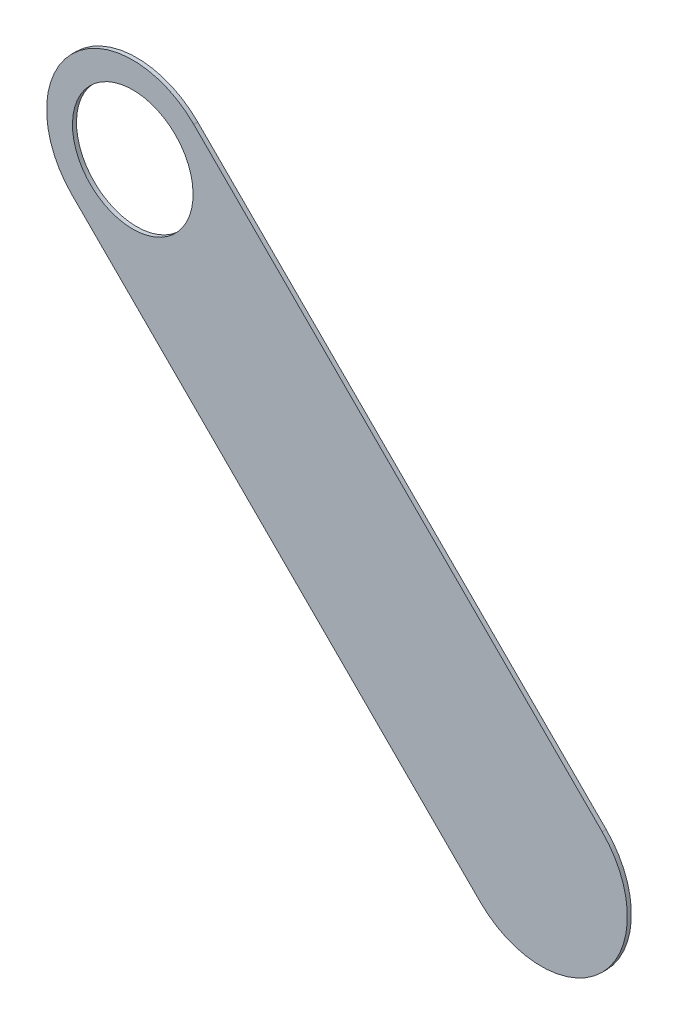
ISO-10303-21;
HEADER;
FILE_DESCRIPTION(('STEP AP214'),'2;1');
FILE_NAME('part.step','',(''),(''),'','','');
FILE_SCHEMA(('AUTOMOTIVE_DESIGN { 1 0 10303 214 1 1 1 1 }'));
ENDSEC;
DATA;
#1=APPLICATION_CONTEXT('core data for automotive mechanical design processes');
#2=APPLICATION_PROTOCOL_DEFINITION('international standard','automotive_design',2000,#1);
#3=PRODUCT_CONTEXT('',#1,'mechanical');
#4=PRODUCT('Part','Part','',(#3));
#5=PRODUCT_RELATED_PRODUCT_CATEGORY('part','',(#4));
#6=PRODUCT_DEFINITION_FORMATION('','',#4);
#7=PRODUCT_DEFINITION_CONTEXT('part definition',#1,'design');
#8=PRODUCT_DEFINITION('design','',#6,#7);
#9=PRODUCT_DEFINITION_SHAPE('','',#8);
#10=(LENGTH_UNIT() NAMED_UNIT(*) SI_UNIT(.MILLI.,.METRE.));
#11=(NAMED_UNIT(*) PLANE_ANGLE_UNIT() SI_UNIT($,.RADIAN.));
#12=(NAMED_UNIT(*) SI_UNIT($,.STERADIAN.) SOLID_ANGLE_UNIT());
#13=UNCERTAINTY_MEASURE_WITH_UNIT(LENGTH_MEASURE(1.E-05),#10,'distance_accuracy_value','');
#14=(GEOMETRIC_REPRESENTATION_CONTEXT(3) GLOBAL_UNCERTAINTY_ASSIGNED_CONTEXT((#13)) GLOBAL_UNIT_ASSIGNED_CONTEXT((#10,
#11,#12)) REPRESENTATION_CONTEXT('',''));
#15=CARTESIAN_POINT('',(0.,0.,0.));
#16=DIRECTION('',(0.,0.,1.));
#17=DIRECTION('',(1.,0.,0.));
#18=AXIS2_PLACEMENT_3D('',#15,#16,#17);
#19=CARTESIAN_POINT('',(123.952,-121.234,-0.045));
#20=DIRECTION('',(0.,0.,-1.));
#21=DIRECTION('',(0.,-1.,0.));
#22=AXIS2_PLACEMENT_3D('',#19,#20,#21);
#23=CYLINDRICAL_SURFACE('',#22,0.525);
#24=CARTESIAN_POINT('',(123.952,-121.234,-0.035));
#25=DIRECTION('',(0.,0.,-1.));
#26=DIRECTION('',(0.,-1.,0.));
#27=AXIS2_PLACEMENT_3D('',#24,#25,#26);
#28=CIRCLE('',#27,0.525);
#29=CARTESIAN_POINT('',(123.952,-121.759,-0.035));
#30=VERTEX_POINT('',#29);
#31=EDGE_CURVE('E132',#30,#30,#28,.T.);
#32=ORIENTED_EDGE('',*,*,#31,.T.);
#33=DIRECTION('',(0.,0.,1.));
#34=VECTOR('',#33,1.);
#35=CARTESIAN_POINT('',(123.952,-121.759,-0.045));
#36=LINE('',#35,#34);
#37=CARTESIAN_POINT('',(123.952,-121.759,0.));
#38=VERTEX_POINT('',#37);
#39=EDGE_CURVE('E11',#30,#38,#36,.T.);
#40=ORIENTED_EDGE('',*,*,#39,.T.);
#41=CARTESIAN_POINT('',(123.952,-121.234,0.));
#42=DIRECTION('',(0.,0.,-1.));
#43=DIRECTION('',(0.,-1.,0.));
#44=AXIS2_PLACEMENT_3D('',#41,#42,#43);
#45=CIRCLE('',#44,0.525);
#46=EDGE_CURVE('E26',#38,#38,#45,.T.);
#47=ORIENTED_EDGE('',*,*,#46,.F.);
#48=ORIENTED_EDGE('',*,*,#39,.F.);
#49=EDGE_LOOP('',(#32,#40,#47,#48));
#50=FACE_BOUND('',#49,.T.);
#51=ADVANCED_FACE('F17',(#50),#23,.F.);
#52=CARTESIAN_POINT('',(128.03833,-124.259669,-0.035));
#53=DIRECTION('',(-0.707106781186548,-0.707106781186548,0.));
#54=DIRECTION('',(-0.707106781186548,0.707106781186548,0.));
#55=AXIS2_PLACEMENT_3D('',#52,#53,#54);
#56=PLANE('',#55);
#57=DIRECTION('',(-0.707106781186548,0.707106781186548,0.));
#58=VECTOR('',#57,1.);
#59=CARTESIAN_POINT('',(128.03833,-124.259669,-0.035));
#60=LINE('',#59,#58);
#61=CARTESIAN_POINT('',(128.03833,-124.259669,-0.035));
#62=VERTEX_POINT('',#61);
#63=CARTESIAN_POINT('',(124.48233,-120.703669,-0.035));
#64=VERTEX_POINT('',#63);
#65=EDGE_CURVE('E130',#62,#64,#60,.T.);
#66=ORIENTED_EDGE('',*,*,#65,.T.);
#67=DIRECTION('',(0.,0.,1.));
#68=VECTOR('',#67,1.);
#69=CARTESIAN_POINT('',(124.48233,-120.703669,-0.035));
#70=LINE('',#69,#68);
#71=CARTESIAN_POINT('',(124.48233,-120.703669,0.));
#72=VERTEX_POINT('',#71);
#73=EDGE_CURVE('E85',#64,#72,#70,.T.);
#74=ORIENTED_EDGE('',*,*,#73,.T.);
#75=DIRECTION('',(-0.707106781186548,0.707106781186548,0.));
#76=VECTOR('',#75,1.);
#77=CARTESIAN_POINT('',(128.03833,-124.259669,0.));
#78=LINE('',#77,#76);
#79=CARTESIAN_POINT('',(128.03833,-124.259669,0.));
#80=VERTEX_POINT('',#79);
#81=EDGE_CURVE('E20',#80,#72,#78,.T.);
#82=ORIENTED_EDGE('',*,*,#81,.F.);
#83=DIRECTION('',(0.,0.,1.));
#84=VECTOR('',#83,1.);
#85=CARTESIAN_POINT('',(128.03833,-124.259669,-0.035));
#86=LINE('',#85,#84);
#87=EDGE_CURVE('E114',#62,#80,#86,.T.);
#88=ORIENTED_EDGE('',*,*,#87,.F.);
#89=EDGE_LOOP('',(#66,#74,#82,#88));
#90=FACE_BOUND('',#89,.T.);
#91=ADVANCED_FACE('F144',(#90),#56,.F.);
#92=CARTESIAN_POINT('',(123.421669,-121.76433,0.));
#93=DIRECTION('',(0.,0.,1.));
#94=DIRECTION('',(1.,0.,0.));
#95=AXIS2_PLACEMENT_3D('',#92,#93,#94);
#96=PLANE('',#95);
#97=ORIENTED_EDGE('',*,*,#46,.T.);
#98=EDGE_LOOP('',(#97));
#99=FACE_BOUND('',#98,.T.);
#100=DIRECTION('',(0.707106781186548,-0.707106781186548,0.));
#101=VECTOR('',#100,1.);
#102=CARTESIAN_POINT('',(123.421669,-121.76433,0.));
#103=LINE('',#102,#101);
#104=CARTESIAN_POINT('',(123.421669,-121.76433,0.));
#105=VERTEX_POINT('',#104);
#106=CARTESIAN_POINT('',(126.977669,-125.32033,0.));
#107=VERTEX_POINT('',#106);
#108=EDGE_CURVE('E97',#105,#107,#103,.T.);
#109=ORIENTED_EDGE('',*,*,#108,.T.);
#110=CARTESIAN_POINT('',(127.5079995,-124.7899995,0.));
#111=DIRECTION('',(0.,0.,1.));
#112=DIRECTION('',(-0.707106781186548,-0.707106781186548,0.));
#113=AXIS2_PLACEMENT_3D('',#110,#111,#112);
#114=CIRCLE('',#113,0.75000058564);
#115=EDGE_CURVE('E118',#107,#80,#114,.T.);
#116=ORIENTED_EDGE('',*,*,#115,.T.);
#117=ORIENTED_EDGE('',*,*,#81,.T.);
#118=CARTESIAN_POINT('',(123.9519995,-121.2339995,0.));
#119=DIRECTION('',(0.,0.,1.));
#120=DIRECTION('',(0.707106781186548,0.707106781186548,0.));
#121=AXIS2_PLACEMENT_3D('',#118,#119,#120);
#122=CIRCLE('',#121,0.75000058564);
#123=EDGE_CURVE('E89',#72,#105,#122,.T.);
#124=ORIENTED_EDGE('',*,*,#123,.T.);
#125=EDGE_LOOP('',(#109,#116,#117,#124));
#126=FACE_BOUND('',#125,.T.);
#127=ADVANCED_FACE('F141',(#99,#126),#96,.T.);
#128=CARTESIAN_POINT('',(123.421669,-121.76433,-0.035));
#129=DIRECTION('',(0.,0.,1.));
#130=DIRECTION('',(1.,0.,0.));
#131=AXIS2_PLACEMENT_3D('',#128,#129,#130);
#132=PLANE('',#131);
#133=ORIENTED_EDGE('',*,*,#31,.F.);
#134=EDGE_LOOP('',(#133));
#135=FACE_BOUND('',#134,.T.);
#136=CARTESIAN_POINT('',(123.9519995,-121.2339995,-0.035));
#137=DIRECTION('',(0.,0.,1.));
#138=DIRECTION('',(0.707106781186548,0.707106781186548,0.));
#139=AXIS2_PLACEMENT_3D('',#136,#137,#138);
#140=CIRCLE('',#139,0.75000058564);
#141=CARTESIAN_POINT('',(123.421669,-121.76433,-0.035));
#142=VERTEX_POINT('',#141);
#143=EDGE_CURVE('E78',#64,#142,#140,.T.);
#144=ORIENTED_EDGE('',*,*,#143,.F.);
#145=ORIENTED_EDGE('',*,*,#65,.F.);
#146=CARTESIAN_POINT('',(127.5079995,-124.7899995,-0.035));
#147=DIRECTION('',(0.,0.,1.));
#148=DIRECTION('',(-0.707106781186548,-0.707106781186548,0.));
#149=AXIS2_PLACEMENT_3D('',#146,#147,#148);
#150=CIRCLE('',#149,0.75000058564);
#151=CARTESIAN_POINT('',(126.977669,-125.32033,-0.035));
#152=VERTEX_POINT('',#151);
#153=EDGE_CURVE('E102',#152,#62,#150,.T.);
#154=ORIENTED_EDGE('',*,*,#153,.F.);
#155=DIRECTION('',(0.707106781186548,-0.707106781186548,0.));
#156=VECTOR('',#155,1.);
#157=CARTESIAN_POINT('',(123.421669,-121.76433,-0.035));
#158=LINE('',#157,#156);
#159=EDGE_CURVE('E95',#142,#152,#158,.T.);
#160=ORIENTED_EDGE('',*,*,#159,.F.);
#161=EDGE_LOOP('',(#144,#145,#154,#160));
#162=FACE_BOUND('',#161,.T.);
#163=ADVANCED_FACE('F100',(#135,#162),#132,.F.);
#164=CARTESIAN_POINT('',(127.5079995,-124.7899995,-0.035));
#165=DIRECTION('',(0.,0.,-1.));
#166=DIRECTION('',(-0.707106781186548,-0.707106781186548,0.));
#167=AXIS2_PLACEMENT_3D('',#164,#165,#166);
#168=CYLINDRICAL_SURFACE('',#167,0.75000058564);
#169=ORIENTED_EDGE('',*,*,#153,.T.);
#170=ORIENTED_EDGE('',*,*,#87,.T.);
#171=ORIENTED_EDGE('',*,*,#115,.F.);
#172=DIRECTION('',(0.,0.,1.));
#173=VECTOR('',#172,1.);
#174=CARTESIAN_POINT('',(126.977669,-125.32033,-0.035));
#175=LINE('',#174,#173);
#176=EDGE_CURVE('E105',#152,#107,#175,.T.);
#177=ORIENTED_EDGE('',*,*,#176,.F.);
#178=EDGE_LOOP('',(#169,#170,#171,#177));
#179=FACE_BOUND('',#178,.T.);
#180=ADVANCED_FACE('F146',(#179),#168,.T.);
#181=CARTESIAN_POINT('',(123.9519995,-121.2339995,-0.035));
#182=DIRECTION('',(0.,0.,-1.));
#183=DIRECTION('',(0.707106781186548,0.707106781186548,0.));
#184=AXIS2_PLACEMENT_3D('',#181,#182,#183);
#185=CYLINDRICAL_SURFACE('',#184,0.75000058564);
#186=ORIENTED_EDGE('',*,*,#143,.T.);
#187=DIRECTION('',(0.,0.,1.));
#188=VECTOR('',#187,1.);
#189=CARTESIAN_POINT('',(123.421669,-121.76433,-0.035));
#190=LINE('',#189,#188);
#191=EDGE_CURVE('E82',#142,#105,#190,.T.);
#192=ORIENTED_EDGE('',*,*,#191,.T.);
#193=ORIENTED_EDGE('',*,*,#123,.F.);
#194=ORIENTED_EDGE('',*,*,#73,.F.);
#195=EDGE_LOOP('',(#186,#192,#193,#194));
#196=FACE_BOUND('',#195,.T.);
#197=ADVANCED_FACE('F80',(#196),#185,.T.);
#198=CARTESIAN_POINT('',(123.421669,-121.76433,-0.035));
#199=DIRECTION('',(0.707106781186548,0.707106781186548,0.));
#200=DIRECTION('',(0.,0.,-1.));
#201=AXIS2_PLACEMENT_3D('',#198,#199,#200);
#202=PLANE('',#201);
#203=ORIENTED_EDGE('',*,*,#159,.T.);
#204=ORIENTED_EDGE('',*,*,#176,.T.);
#205=ORIENTED_EDGE('',*,*,#108,.F.);
#206=ORIENTED_EDGE('',*,*,#191,.F.);
#207=EDGE_LOOP('',(#203,#204,#205,#206));
#208=FACE_BOUND('',#207,.T.);
#209=ADVANCED_FACE('F93',(#208),#202,.F.);
#210=CLOSED_SHELL('',(#51,#91,#127,#163,#180,#197,#209));
#211=MANIFOLD_SOLID_BREP('B1',#210);
#212=ADVANCED_BREP_SHAPE_REPRESENTATION('',(#18,#211),#14);
#213=SHAPE_DEFINITION_REPRESENTATION(#9,#212);
ENDSEC;
END-ISO-10303-21;
